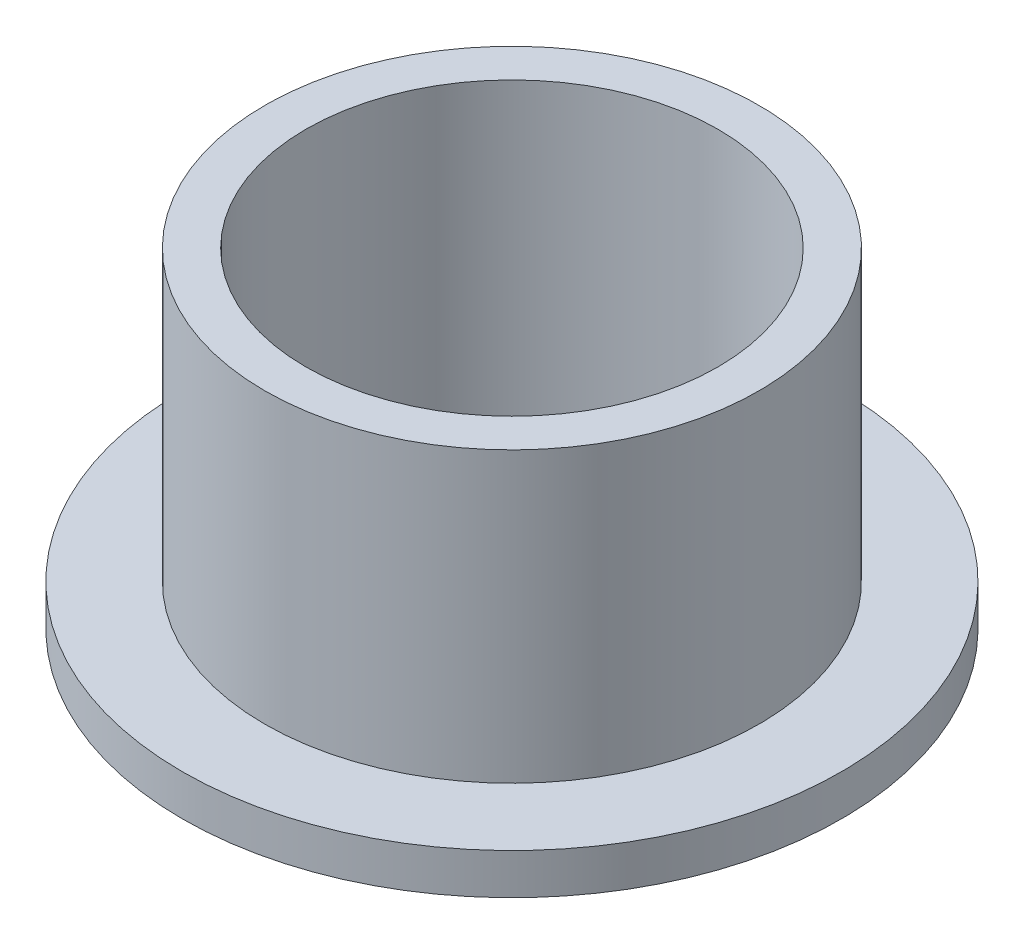
ISO-10303-21;
HEADER;
FILE_DESCRIPTION(('STEP AP214'),'2;1');
FILE_NAME('part.step','',(''),(''),'','','');
FILE_SCHEMA(('AUTOMOTIVE_DESIGN { 1 0 10303 214 1 1 1 1 }'));
ENDSEC;
DATA;
#1=APPLICATION_CONTEXT('core data for automotive mechanical design processes');
#2=APPLICATION_PROTOCOL_DEFINITION('international standard','automotive_design',2000,#1);
#3=PRODUCT_CONTEXT('',#1,'mechanical');
#4=PRODUCT('Part','Part','',(#3));
#5=PRODUCT_RELATED_PRODUCT_CATEGORY('part','',(#4));
#6=PRODUCT_DEFINITION_FORMATION('','',#4);
#7=PRODUCT_DEFINITION_CONTEXT('part definition',#1,'design');
#8=PRODUCT_DEFINITION('design','',#6,#7);
#9=PRODUCT_DEFINITION_SHAPE('','',#8);
#10=(LENGTH_UNIT() NAMED_UNIT(*) SI_UNIT(.MILLI.,.METRE.));
#11=(NAMED_UNIT(*) PLANE_ANGLE_UNIT() SI_UNIT($,.RADIAN.));
#12=(NAMED_UNIT(*) SI_UNIT($,.STERADIAN.) SOLID_ANGLE_UNIT());
#13=UNCERTAINTY_MEASURE_WITH_UNIT(LENGTH_MEASURE(1.E-05),#10,'distance_accuracy_value','');
#14=(GEOMETRIC_REPRESENTATION_CONTEXT(3) GLOBAL_UNCERTAINTY_ASSIGNED_CONTEXT((#13)) GLOBAL_UNIT_ASSIGNED_CONTEXT((#10,
#11,#12)) REPRESENTATION_CONTEXT('',''));
#15=CARTESIAN_POINT('',(0.,0.,0.));
#16=DIRECTION('',(0.,0.,1.));
#17=DIRECTION('',(1.,0.,0.));
#18=AXIS2_PLACEMENT_3D('',#15,#16,#17);
#19=CARTESIAN_POINT('',(0.,26.7127403846154,0.));
#20=DIRECTION('',(0.,1.,0.));
#21=DIRECTION('',(0.,0.,1.));
#22=AXIS2_PLACEMENT_3D('',#19,#20,#21);
#23=CYLINDRICAL_SURFACE('',#22,7.9375);
#24=CARTESIAN_POINT('',(0.,0.,0.));
#25=DIRECTION('',(0.,1.,0.));
#26=DIRECTION('',(0.,0.,1.));
#27=AXIS2_PLACEMENT_3D('',#24,#25,#26);
#28=CIRCLE('',#27,7.9375);
#29=CARTESIAN_POINT('',(0.,0.,7.9375));
#30=VERTEX_POINT('',#29);
#31=EDGE_CURVE('E10',#30,#30,#28,.T.);
#32=ORIENTED_EDGE('',*,*,#31,.F.);
#33=EDGE_LOOP('',(#32));
#34=FACE_BOUND('',#33,.T.);
#35=CARTESIAN_POINT('',(0.,12.7,0.));
#36=DIRECTION('',(0.,1.,0.));
#37=DIRECTION('',(0.,0.,1.));
#38=AXIS2_PLACEMENT_3D('',#35,#36,#37);
#39=CIRCLE('',#38,7.9375);
#40=CARTESIAN_POINT('',(0.,12.7,7.9375));
#41=VERTEX_POINT('',#40);
#42=EDGE_CURVE('E52',#41,#41,#39,.T.);
#43=ORIENTED_EDGE('',*,*,#42,.T.);
#44=EDGE_LOOP('',(#43));
#45=FACE_BOUND('',#44,.T.);
#46=ADVANCED_FACE('F30',(#34,#45),#23,.F.);
#47=CARTESIAN_POINT('',(7.9375,0.,0.));
#48=DIRECTION('',(0.,1.,0.));
#49=DIRECTION('',(0.,0.,1.));
#50=AXIS2_PLACEMENT_3D('',#47,#48,#49);
#51=PLANE('',#50);
#52=CARTESIAN_POINT('',(0.,0.,0.));
#53=DIRECTION('',(0.,1.,0.));
#54=DIRECTION('',(0.,0.,1.));
#55=AXIS2_PLACEMENT_3D('',#52,#53,#54);
#56=CIRCLE('',#55,12.7);
#57=CARTESIAN_POINT('',(0.,0.,12.7));
#58=VERTEX_POINT('',#57);
#59=EDGE_CURVE('E36',#58,#58,#56,.T.);
#60=ORIENTED_EDGE('',*,*,#59,.F.);
#61=EDGE_LOOP('',(#60));
#62=FACE_BOUND('',#61,.T.);
#63=ORIENTED_EDGE('',*,*,#31,.T.);
#64=EDGE_LOOP('',(#63));
#65=FACE_BOUND('',#64,.T.);
#66=ADVANCED_FACE('F77',(#62,#65),#51,.F.);
#67=CARTESIAN_POINT('',(0.,26.7127403846154,0.));
#68=DIRECTION('',(0.,1.,0.));
#69=DIRECTION('',(0.,0.,1.));
#70=AXIS2_PLACEMENT_3D('',#67,#68,#69);
#71=CYLINDRICAL_SURFACE('',#70,12.7);
#72=CARTESIAN_POINT('',(0.,1.5748,0.));
#73=DIRECTION('',(0.,1.,0.));
#74=DIRECTION('',(0.,0.,1.));
#75=AXIS2_PLACEMENT_3D('',#72,#73,#74);
#76=CIRCLE('',#75,12.7);
#77=CARTESIAN_POINT('',(0.,1.5748,12.7));
#78=VERTEX_POINT('',#77);
#79=EDGE_CURVE('E40',#78,#78,#76,.T.);
#80=ORIENTED_EDGE('',*,*,#79,.F.);
#81=EDGE_LOOP('',(#80));
#82=FACE_BOUND('',#81,.T.);
#83=ORIENTED_EDGE('',*,*,#59,.T.);
#84=EDGE_LOOP('',(#83));
#85=FACE_BOUND('',#84,.T.);
#86=ADVANCED_FACE('F72',(#82,#85),#71,.T.);
#87=CARTESIAN_POINT('',(12.7,1.5748,0.));
#88=DIRECTION('',(0.,-1.,0.));
#89=DIRECTION('',(0.,0.,-1.));
#90=AXIS2_PLACEMENT_3D('',#87,#88,#89);
#91=PLANE('',#90);
#92=CARTESIAN_POINT('',(0.,1.5748,0.));
#93=DIRECTION('',(0.,1.,0.));
#94=DIRECTION('',(0.,0.,1.));
#95=AXIS2_PLACEMENT_3D('',#92,#93,#94);
#96=CIRCLE('',#95,9.525);
#97=CARTESIAN_POINT('',(0.,1.5748,9.525));
#98=VERTEX_POINT('',#97);
#99=EDGE_CURVE('E44',#98,#98,#96,.T.);
#100=ORIENTED_EDGE('',*,*,#99,.F.);
#101=EDGE_LOOP('',(#100));
#102=FACE_BOUND('',#101,.T.);
#103=ORIENTED_EDGE('',*,*,#79,.T.);
#104=EDGE_LOOP('',(#103));
#105=FACE_BOUND('',#104,.T.);
#106=ADVANCED_FACE('F66',(#102,#105),#91,.F.);
#107=CARTESIAN_POINT('',(0.,26.7127403846154,0.));
#108=DIRECTION('',(0.,1.,0.));
#109=DIRECTION('',(0.,0.,1.));
#110=AXIS2_PLACEMENT_3D('',#107,#108,#109);
#111=CYLINDRICAL_SURFACE('',#110,9.525);
#112=CARTESIAN_POINT('',(0.,12.7,0.));
#113=DIRECTION('',(0.,1.,0.));
#114=DIRECTION('',(0.,0.,1.));
#115=AXIS2_PLACEMENT_3D('',#112,#113,#114);
#116=CIRCLE('',#115,9.525);
#117=CARTESIAN_POINT('',(0.,12.7,9.525));
#118=VERTEX_POINT('',#117);
#119=EDGE_CURVE('E49',#118,#118,#116,.T.);
#120=ORIENTED_EDGE('',*,*,#119,.F.);
#121=EDGE_LOOP('',(#120));
#122=FACE_BOUND('',#121,.T.);
#123=ORIENTED_EDGE('',*,*,#99,.T.);
#124=EDGE_LOOP('',(#123));
#125=FACE_BOUND('',#124,.T.);
#126=ADVANCED_FACE('F60',(#122,#125),#111,.T.);
#127=CARTESIAN_POINT('',(9.525,12.7,0.));
#128=DIRECTION('',(0.,-1.,0.));
#129=DIRECTION('',(0.,0.,-1.));
#130=AXIS2_PLACEMENT_3D('',#127,#128,#129);
#131=PLANE('',#130);
#132=ORIENTED_EDGE('',*,*,#42,.F.);
#133=EDGE_LOOP('',(#132));
#134=FACE_BOUND('',#133,.T.);
#135=ORIENTED_EDGE('',*,*,#119,.T.);
#136=EDGE_LOOP('',(#135));
#137=FACE_BOUND('',#136,.T.);
#138=ADVANCED_FACE('F57',(#134,#137),#131,.F.);
#139=CLOSED_SHELL('',(#46,#66,#86,#106,#126,#138));
#140=MANIFOLD_SOLID_BREP('B2',#139);
#141=ADVANCED_BREP_SHAPE_REPRESENTATION('',(#18,#140),#14);
#142=SHAPE_DEFINITION_REPRESENTATION(#9,#141);
ENDSEC;
END-ISO-10303-21;
